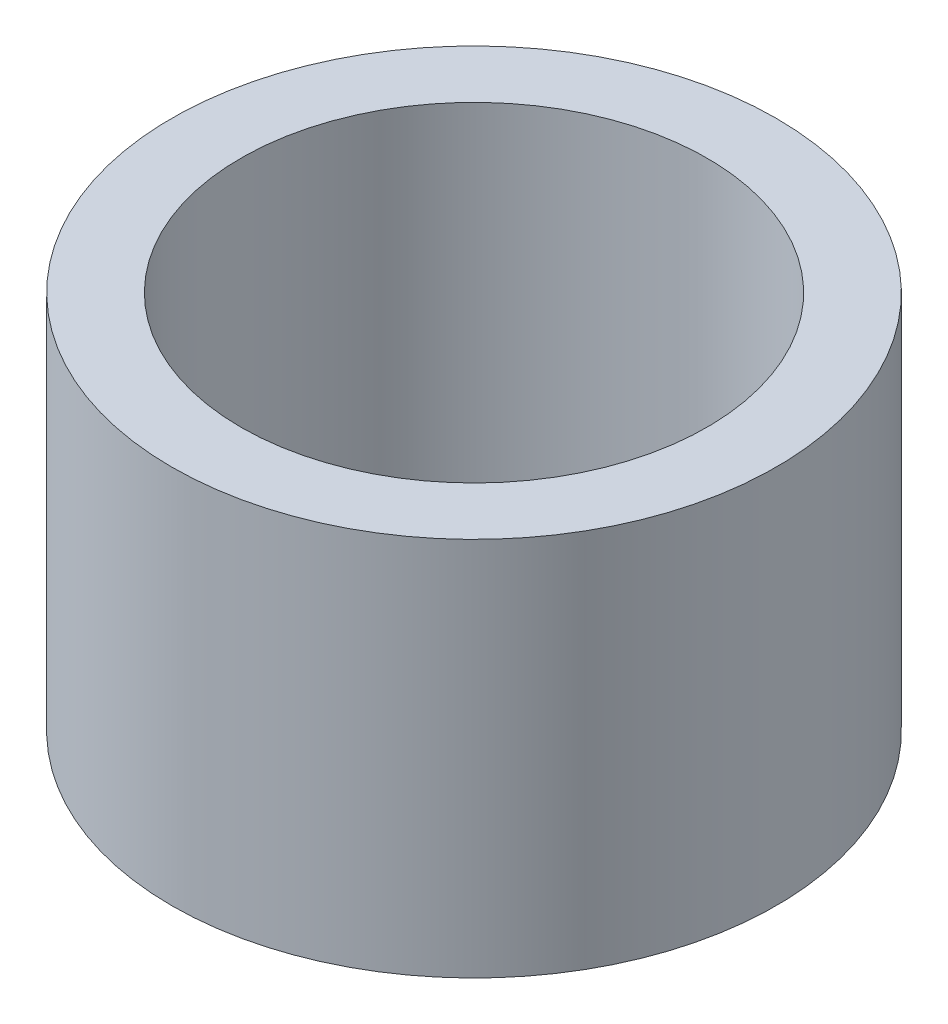
ISO-10303-21;
HEADER;
FILE_DESCRIPTION(('STEP AP214'),'2;1');
FILE_NAME('part.step','',(''),(''),'','','');
FILE_SCHEMA(('AUTOMOTIVE_DESIGN { 1 0 10303 214 1 1 1 1 }'));
ENDSEC;
DATA;
#1=APPLICATION_CONTEXT('core data for automotive mechanical design processes');
#2=APPLICATION_PROTOCOL_DEFINITION('international standard','automotive_design',2000,#1);
#3=PRODUCT_CONTEXT('',#1,'mechanical');
#4=PRODUCT('Part','Part','',(#3));
#5=PRODUCT_RELATED_PRODUCT_CATEGORY('part','',(#4));
#6=PRODUCT_DEFINITION_FORMATION('','',#4);
#7=PRODUCT_DEFINITION_CONTEXT('part definition',#1,'design');
#8=PRODUCT_DEFINITION('design','',#6,#7);
#9=PRODUCT_DEFINITION_SHAPE('','',#8);
#10=(LENGTH_UNIT() NAMED_UNIT(*) SI_UNIT(.MILLI.,.METRE.));
#11=(NAMED_UNIT(*) PLANE_ANGLE_UNIT() SI_UNIT($,.RADIAN.));
#12=(NAMED_UNIT(*) SI_UNIT($,.STERADIAN.) SOLID_ANGLE_UNIT());
#13=UNCERTAINTY_MEASURE_WITH_UNIT(LENGTH_MEASURE(1.E-05),#10,'distance_accuracy_value','');
#14=(GEOMETRIC_REPRESENTATION_CONTEXT(3) GLOBAL_UNCERTAINTY_ASSIGNED_CONTEXT((#13)) GLOBAL_UNIT_ASSIGNED_CONTEXT((#10,
#11,#12)) REPRESENTATION_CONTEXT('',''));
#15=CARTESIAN_POINT('',(0.,0.,0.));
#16=DIRECTION('',(0.,0.,1.));
#17=DIRECTION('',(1.,0.,0.));
#18=AXIS2_PLACEMENT_3D('',#15,#16,#17);
#19=CARTESIAN_POINT('',(0.,5.5,0.));
#20=DIRECTION('',(0.,1.,0.));
#21=DIRECTION('',(0.,0.,1.));
#22=AXIS2_PLACEMENT_3D('',#19,#20,#21);
#23=PLANE('',#22);
#24=CARTESIAN_POINT('',(0.,5.5,0.));
#25=DIRECTION('',(0.,1.,0.));
#26=DIRECTION('',(0.,0.,1.));
#27=AXIS2_PLACEMENT_3D('',#24,#25,#26);
#28=CIRCLE('',#27,4.375);
#29=CARTESIAN_POINT('',(0.,5.5,4.375));
#30=VERTEX_POINT('',#29);
#31=EDGE_CURVE('E10',#30,#30,#28,.T.);
#32=ORIENTED_EDGE('',*,*,#31,.T.);
#33=EDGE_LOOP('',(#32));
#34=FACE_BOUND('',#33,.T.);
#35=CARTESIAN_POINT('',(0.,5.5,0.));
#36=DIRECTION('',(0.,1.,0.));
#37=DIRECTION('',(0.,0.,1.));
#38=AXIS2_PLACEMENT_3D('',#35,#36,#37);
#39=CIRCLE('',#38,3.375);
#40=CARTESIAN_POINT('',(0.,5.5,3.375));
#41=VERTEX_POINT('',#40);
#42=EDGE_CURVE('E42',#41,#41,#39,.T.);
#43=ORIENTED_EDGE('',*,*,#42,.F.);
#44=EDGE_LOOP('',(#43));
#45=FACE_BOUND('',#44,.T.);
#46=ADVANCED_FACE('F31',(#34,#45),#23,.T.);
#47=CARTESIAN_POINT('',(0.,0.,0.));
#48=DIRECTION('',(0.,1.,0.));
#49=DIRECTION('',(0.,0.,1.));
#50=AXIS2_PLACEMENT_3D('',#47,#48,#49);
#51=PLANE('',#50);
#52=CARTESIAN_POINT('',(0.,0.,0.));
#53=DIRECTION('',(0.,1.,0.));
#54=DIRECTION('',(0.,0.,1.));
#55=AXIS2_PLACEMENT_3D('',#52,#53,#54);
#56=CIRCLE('',#55,4.375);
#57=CARTESIAN_POINT('',(0.,0.,4.375));
#58=VERTEX_POINT('',#57);
#59=EDGE_CURVE('E35',#58,#58,#56,.T.);
#60=ORIENTED_EDGE('',*,*,#59,.F.);
#61=EDGE_LOOP('',(#60));
#62=FACE_BOUND('',#61,.T.);
#63=CARTESIAN_POINT('',(0.,0.,0.));
#64=DIRECTION('',(0.,1.,0.));
#65=DIRECTION('',(0.,0.,1.));
#66=AXIS2_PLACEMENT_3D('',#63,#64,#65);
#67=CIRCLE('',#66,3.375);
#68=CARTESIAN_POINT('',(0.,0.,3.375));
#69=VERTEX_POINT('',#68);
#70=EDGE_CURVE('E44',#69,#69,#67,.T.);
#71=ORIENTED_EDGE('',*,*,#70,.T.);
#72=EDGE_LOOP('',(#71));
#73=FACE_BOUND('',#72,.T.);
#74=ADVANCED_FACE('F54',(#62,#73),#51,.F.);
#75=CARTESIAN_POINT('',(0.,5.5,0.));
#76=DIRECTION('',(0.,-1.,0.));
#77=DIRECTION('',(0.,0.,-1.));
#78=AXIS2_PLACEMENT_3D('',#75,#76,#77);
#79=CYLINDRICAL_SURFACE('',#78,4.375);
#80=ORIENTED_EDGE('',*,*,#31,.F.);
#81=EDGE_LOOP('',(#80));
#82=FACE_BOUND('',#81,.T.);
#83=ORIENTED_EDGE('',*,*,#59,.T.);
#84=EDGE_LOOP('',(#83));
#85=FACE_BOUND('',#84,.T.);
#86=ADVANCED_FACE('F33',(#82,#85),#79,.T.);
#87=CARTESIAN_POINT('',(0.,5.5,0.));
#88=DIRECTION('',(0.,-1.,0.));
#89=DIRECTION('',(0.,0.,-1.));
#90=AXIS2_PLACEMENT_3D('',#87,#88,#89);
#91=CYLINDRICAL_SURFACE('',#90,3.375);
#92=ORIENTED_EDGE('',*,*,#42,.T.);
#93=EDGE_LOOP('',(#92));
#94=FACE_BOUND('',#93,.T.);
#95=ORIENTED_EDGE('',*,*,#70,.F.);
#96=EDGE_LOOP('',(#95));
#97=FACE_BOUND('',#96,.T.);
#98=ADVANCED_FACE('F50',(#94,#97),#91,.F.);
#99=CLOSED_SHELL('',(#46,#74,#86,#98));
#100=MANIFOLD_SOLID_BREP('B2',#99);
#101=ADVANCED_BREP_SHAPE_REPRESENTATION('',(#18,#100),#14);
#102=SHAPE_DEFINITION_REPRESENTATION(#9,#101);
ENDSEC;
END-ISO-10303-21;
